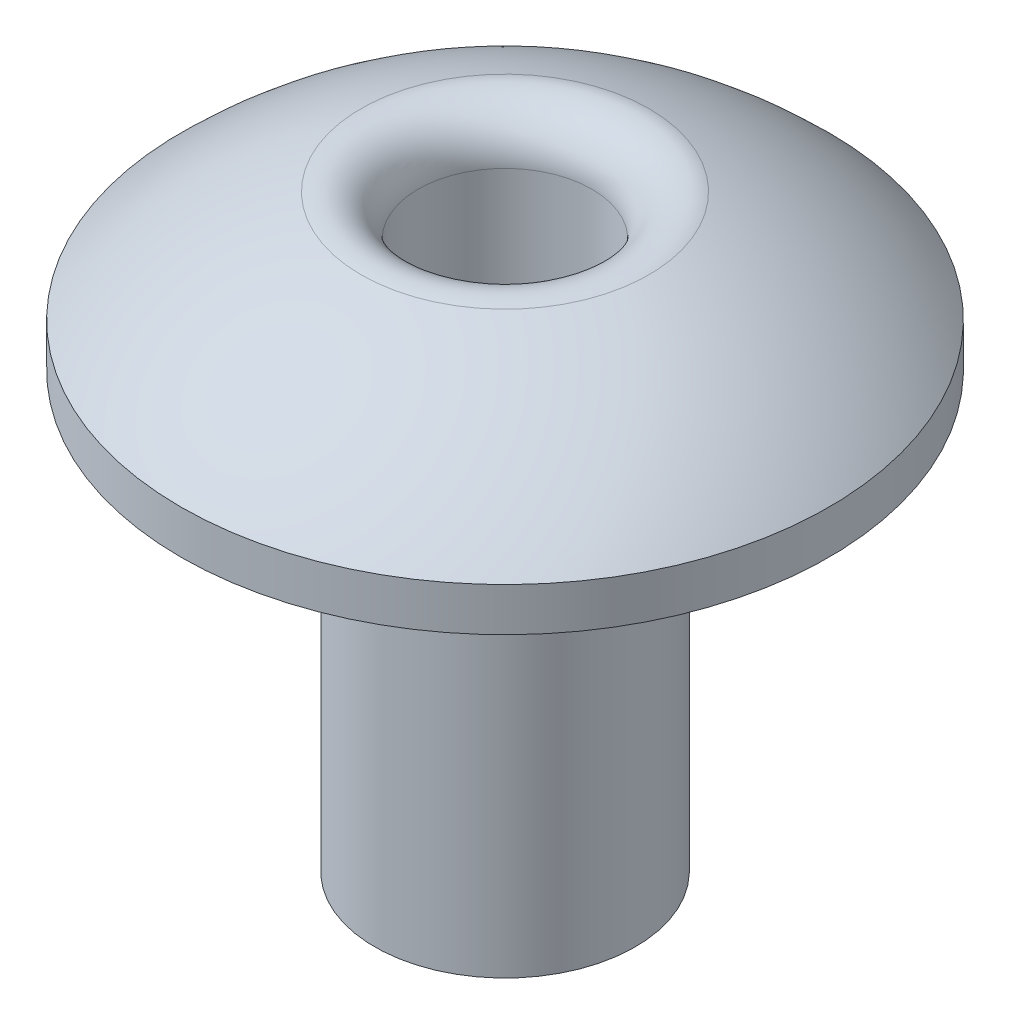
ISO-10303-21;
HEADER;
FILE_DESCRIPTION(('STEP AP214'),'2;1');
FILE_NAME('part.step','',(''),(''),'','','');
FILE_SCHEMA(('AUTOMOTIVE_DESIGN { 1 0 10303 214 1 1 1 1 }'));
ENDSEC;
DATA;
#1=APPLICATION_CONTEXT('core data for automotive mechanical design processes');
#2=APPLICATION_PROTOCOL_DEFINITION('international standard','automotive_design',2000,#1);
#3=PRODUCT_CONTEXT('',#1,'mechanical');
#4=PRODUCT('Part','Part','',(#3));
#5=PRODUCT_RELATED_PRODUCT_CATEGORY('part','',(#4));
#6=PRODUCT_DEFINITION_FORMATION('','',#4);
#7=PRODUCT_DEFINITION_CONTEXT('part definition',#1,'design');
#8=PRODUCT_DEFINITION('design','',#6,#7);
#9=PRODUCT_DEFINITION_SHAPE('','',#8);
#10=(LENGTH_UNIT() NAMED_UNIT(*) SI_UNIT(.MILLI.,.METRE.));
#11=(NAMED_UNIT(*) PLANE_ANGLE_UNIT() SI_UNIT($,.RADIAN.));
#12=(NAMED_UNIT(*) SI_UNIT($,.STERADIAN.) SOLID_ANGLE_UNIT());
#13=UNCERTAINTY_MEASURE_WITH_UNIT(LENGTH_MEASURE(1.E-05),#10,'distance_accuracy_value','');
#14=(GEOMETRIC_REPRESENTATION_CONTEXT(3) GLOBAL_UNCERTAINTY_ASSIGNED_CONTEXT((#13)) GLOBAL_UNIT_ASSIGNED_CONTEXT((#10,
#11,#12)) REPRESENTATION_CONTEXT('',''));
#15=CARTESIAN_POINT('',(0.,0.,0.));
#16=DIRECTION('',(0.,0.,1.));
#17=DIRECTION('',(1.,0.,0.));
#18=AXIS2_PLACEMENT_3D('',#15,#16,#17);
#19=CARTESIAN_POINT('',(0.,-3.41225873932644,0.));
#20=DIRECTION('',(0.,-1.,0.));
#21=DIRECTION('',(0.,0.,1.));
#22=AXIS2_PLACEMENT_3D('',#19,#20,#21);
#23=SPHERICAL_SURFACE('',#22,4.72066893046459);
#24=CARTESIAN_POINT('',(0.,1.06954727316703,0.));
#25=DIRECTION('',(0.,-1.,0.));
#26=DIRECTION('',(0.,0.,-1.));
#27=AXIS2_PLACEMENT_3D('',#24,#25,#26);
#28=CIRCLE('',#27,1.48260919241421);
#29=CARTESIAN_POINT('',(0.,1.06954727316703,-1.48260919241421));
#30=VERTEX_POINT('',#29);
#31=EDGE_CURVE('E49',#30,#30,#28,.T.);
#32=ORIENTED_EDGE('',*,*,#31,.T.);
#33=EDGE_LOOP('',(#32));
#34=FACE_BOUND('',#33,.T.);
#35=CARTESIAN_POINT('',(0.,-0.0742417268582773,0.));
#36=DIRECTION('',(0.,-1.,0.));
#37=DIRECTION('',(0.,0.,-1.));
#38=AXIS2_PLACEMENT_3D('',#35,#36,#37);
#39=CIRCLE('',#38,3.33801701246816);
#40=CARTESIAN_POINT('',(0.,-0.0742417268582773,-3.33801701246816));
#41=VERTEX_POINT('',#40);
#42=EDGE_CURVE('E65',#41,#41,#39,.T.);
#43=ORIENTED_EDGE('',*,*,#42,.F.);
#44=EDGE_LOOP('',(#43));
#45=FACE_BOUND('',#44,.T.);
#46=ADVANCED_FACE('F41',(#34,#45),#23,.T.);
#47=CARTESIAN_POINT('',(0.,-0.521610147913523,3.33801701246816));
#48=DIRECTION('',(0.,1.,0.));
#49=DIRECTION('',(0.,0.,1.));
#50=AXIS2_PLACEMENT_3D('',#47,#48,#49);
#51=PLANE('',#50);
#52=CARTESIAN_POINT('',(0.,-0.521610147913523,0.));
#53=DIRECTION('',(0.,-1.,0.));
#54=DIRECTION('',(0.,0.,-1.));
#55=AXIS2_PLACEMENT_3D('',#52,#53,#54);
#56=CIRCLE('',#55,1.34210526315789);
#57=CARTESIAN_POINT('',(0.,-0.521610147913523,-1.34210526315789));
#58=VERTEX_POINT('',#57);
#59=EDGE_CURVE('E54',#58,#58,#56,.T.);
#60=ORIENTED_EDGE('',*,*,#59,.F.);
#61=EDGE_LOOP('',(#60));
#62=FACE_BOUND('',#61,.T.);
#63=CARTESIAN_POINT('',(0.,-0.521610147910909,0.));
#64=DIRECTION('',(0.,-1.,0.));
#65=DIRECTION('',(0.,0.,-1.));
#66=AXIS2_PLACEMENT_3D('',#63,#64,#65);
#67=CIRCLE('',#66,3.33801701246816);
#68=CARTESIAN_POINT('',(0.,-0.521610147910909,-3.33801701246816));
#69=VERTEX_POINT('',#68);
#70=EDGE_CURVE('E59',#69,#69,#67,.T.);
#71=ORIENTED_EDGE('',*,*,#70,.T.);
#72=EDGE_LOOP('',(#71));
#73=FACE_BOUND('',#72,.T.);
#74=ADVANCED_FACE('F93',(#62,#73),#51,.F.);
#75=CARTESIAN_POINT('',(0.,-0.521610147916138,0.));
#76=DIRECTION('',(0.,-1.,0.));
#77=DIRECTION('',(0.,0.,-1.));
#78=AXIS2_PLACEMENT_3D('',#75,#76,#77);
#79=CYLINDRICAL_SURFACE('',#78,3.33801701246816);
#80=ORIENTED_EDGE('',*,*,#70,.F.);
#81=EDGE_LOOP('',(#80));
#82=FACE_BOUND('',#81,.T.);
#83=ORIENTED_EDGE('',*,*,#42,.T.);
#84=EDGE_LOOP('',(#83));
#85=FACE_BOUND('',#84,.T.);
#86=ADVANCED_FACE('F89',(#82,#85),#79,.T.);
#87=CARTESIAN_POINT('',(0.,-4.99529435843984,0.));
#88=DIRECTION('',(0.,1.,0.));
#89=DIRECTION('',(0.,0.,1.));
#90=AXIS2_PLACEMENT_3D('',#87,#88,#89);
#91=CYLINDRICAL_SURFACE('',#90,1.34210526315789);
#92=CARTESIAN_POINT('',(0.,-4.99529435843984,0.));
#93=DIRECTION('',(0.,-1.,0.));
#94=DIRECTION('',(0.,0.,-1.));
#95=AXIS2_PLACEMENT_3D('',#92,#93,#94);
#96=CIRCLE('',#95,1.34210526315789);
#97=CARTESIAN_POINT('',(0.,-4.99529435843984,-1.34210526315789));
#98=VERTEX_POINT('',#97);
#99=EDGE_CURVE('E68',#98,#98,#96,.T.);
#100=ORIENTED_EDGE('',*,*,#99,.F.);
#101=EDGE_LOOP('',(#100));
#102=FACE_BOUND('',#101,.T.);
#103=ORIENTED_EDGE('',*,*,#59,.T.);
#104=EDGE_LOOP('',(#103));
#105=FACE_BOUND('',#104,.T.);
#106=ADVANCED_FACE('F83',(#102,#105),#91,.T.);
#107=CARTESIAN_POINT('',(0.,-4.99529435843984,0.));
#108=DIRECTION('',(0.,-1.,0.));
#109=DIRECTION('',(0.,0.,-1.));
#110=AXIS2_PLACEMENT_3D('',#107,#108,#109);
#111=PLANE('',#110);
#112=CARTESIAN_POINT('',(0.,-4.99529435843984,0.));
#113=DIRECTION('',(0.,-1.,0.));
#114=DIRECTION('',(0.,0.,-1.));
#115=AXIS2_PLACEMENT_3D('',#112,#113,#114);
#116=CIRCLE('',#115,0.894736842105263);
#117=CARTESIAN_POINT('',(0.,-4.99529435843984,-0.894736842105263));
#118=VERTEX_POINT('',#117);
#119=EDGE_CURVE('E73',#118,#118,#116,.T.);
#120=ORIENTED_EDGE('',*,*,#119,.F.);
#121=EDGE_LOOP('',(#120));
#122=FACE_BOUND('',#121,.T.);
#123=ORIENTED_EDGE('',*,*,#99,.T.);
#124=EDGE_LOOP('',(#123));
#125=FACE_BOUND('',#124,.T.);
#126=ADVANCED_FACE('F80',(#122,#125),#111,.T.);
#127=CARTESIAN_POINT('',(0.,1.30841019113815,0.));
#128=DIRECTION('',(0.,-1.,0.));
#129=DIRECTION('',(0.,0.,-1.));
#130=AXIS2_PLACEMENT_3D('',#127,#128,#129);
#131=CYLINDRICAL_SURFACE('',#130,0.894736842105263);
#132=CARTESIAN_POINT('',(0.,0.644815416557874,0.));
#133=DIRECTION('',(0.,-1.,0.));
#134=DIRECTION('',(0.,0.,-1.));
#135=AXIS2_PLACEMENT_3D('',#132,#133,#134);
#136=CIRCLE('',#135,0.894736842105263);
#137=CARTESIAN_POINT('',(0.,0.644815416557874,-0.894736842105263));
#138=VERTEX_POINT('',#137);
#139=EDGE_CURVE('E11',#138,#138,#136,.F.);
#140=ORIENTED_EDGE('',*,*,#139,.T.);
#141=EDGE_LOOP('',(#140));
#142=FACE_BOUND('',#141,.T.);
#143=ORIENTED_EDGE('',*,*,#119,.T.);
#144=EDGE_LOOP('',(#143));
#145=FACE_BOUND('',#144,.T.);
#146=ADVANCED_FACE('F78',(#142,#145),#131,.F.);
#147=CARTESIAN_POINT('',(0.,0.644815416557873,0.));
#148=DIRECTION('',(0.,-1.,0.));
#149=DIRECTION('',(0.,0.,-1.));
#150=AXIS2_PLACEMENT_3D('',#147,#148,#149);
#151=TOROIDAL_SURFACE('',#150,1.34210526315789,0.447368421052632);
#152=ORIENTED_EDGE('',*,*,#139,.F.);
#153=EDGE_LOOP('',(#152));
#154=FACE_BOUND('',#153,.T.);
#155=ORIENTED_EDGE('',*,*,#31,.F.);
#156=EDGE_LOOP('',(#155));
#157=FACE_BOUND('',#156,.T.);
#158=ADVANCED_FACE('F43',(#154,#157),#151,.T.);
#159=CLOSED_SHELL('',(#46,#74,#86,#106,#126,#146,#158));
#160=MANIFOLD_SOLID_BREP('B2',#159);
#161=ADVANCED_BREP_SHAPE_REPRESENTATION('',(#18,#160),#14);
#162=SHAPE_DEFINITION_REPRESENTATION(#9,#161);
ENDSEC;
END-ISO-10303-21;
